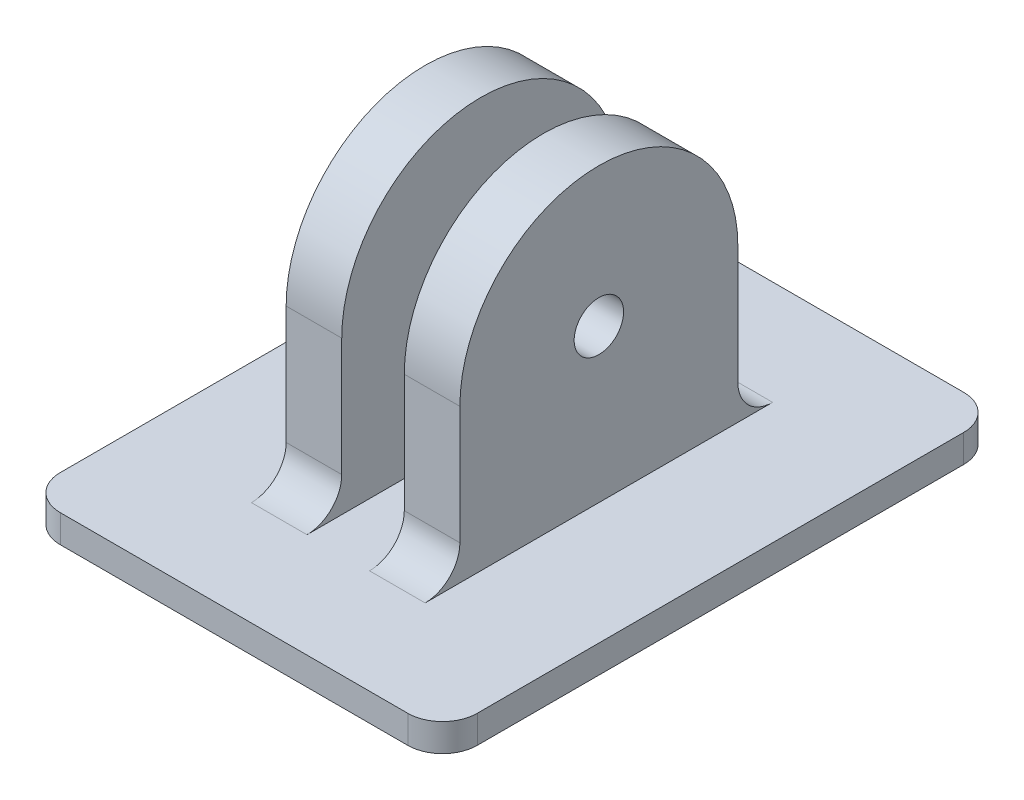
ISO-10303-21;
HEADER;
FILE_DESCRIPTION(('STEP AP214'),'2;1');
FILE_NAME('part.step','',(''),(''),'','','');
FILE_SCHEMA(('AUTOMOTIVE_DESIGN { 1 0 10303 214 1 1 1 1 }'));
ENDSEC;
DATA;
#1=APPLICATION_CONTEXT('core data for automotive mechanical design processes');
#2=APPLICATION_PROTOCOL_DEFINITION('international standard','automotive_design',2000,#1);
#3=PRODUCT_CONTEXT('',#1,'mechanical');
#4=PRODUCT('Part','Part','',(#3));
#5=PRODUCT_RELATED_PRODUCT_CATEGORY('part','',(#4));
#6=PRODUCT_DEFINITION_FORMATION('','',#4);
#7=PRODUCT_DEFINITION_CONTEXT('part definition',#1,'design');
#8=PRODUCT_DEFINITION('design','',#6,#7);
#9=PRODUCT_DEFINITION_SHAPE('','',#8);
#10=(LENGTH_UNIT() NAMED_UNIT(*) SI_UNIT(.MILLI.,.METRE.));
#11=(NAMED_UNIT(*) PLANE_ANGLE_UNIT() SI_UNIT($,.RADIAN.));
#12=(NAMED_UNIT(*) SI_UNIT($,.STERADIAN.) SOLID_ANGLE_UNIT());
#13=UNCERTAINTY_MEASURE_WITH_UNIT(LENGTH_MEASURE(1.E-05),#10,'distance_accuracy_value','');
#14=(GEOMETRIC_REPRESENTATION_CONTEXT(3) GLOBAL_UNCERTAINTY_ASSIGNED_CONTEXT((#13)) GLOBAL_UNIT_ASSIGNED_CONTEXT((#10,
#11,#12)) REPRESENTATION_CONTEXT('',''));
#15=CARTESIAN_POINT('',(0.,0.,0.));
#16=DIRECTION('',(0.,0.,1.));
#17=DIRECTION('',(1.,0.,0.));
#18=AXIS2_PLACEMENT_3D('',#15,#16,#17);
#19=CARTESIAN_POINT('',(0.,2.,0.));
#20=DIRECTION('',(0.,1.,0.));
#21=DIRECTION('',(0.,0.,1.));
#22=AXIS2_PLACEMENT_3D('',#19,#20,#21);
#23=PLANE('',#22);
#24=DIRECTION('',(0.,0.,-1.));
#25=VECTOR('',#24,1.);
#26=CARTESIAN_POINT('',(15.,2.,-20.));
#27=LINE('',#26,#25);
#28=CARTESIAN_POINT('',(15.,2.,17.5));
#29=VERTEX_POINT('',#28);
#30=CARTESIAN_POINT('',(15.,2.,-17.5));
#31=VERTEX_POINT('',#30);
#32=EDGE_CURVE('E251',#29,#31,#27,.T.);
#33=ORIENTED_EDGE('',*,*,#32,.T.);
#34=CARTESIAN_POINT('',(12.5,2.,-17.5));
#35=DIRECTION('',(0.,1.,0.));
#36=DIRECTION('',(0.,0.,1.));
#37=AXIS2_PLACEMENT_3D('',#34,#35,#36);
#38=CIRCLE('',#37,2.5);
#39=CARTESIAN_POINT('',(12.5,2.,-20.));
#40=VERTEX_POINT('',#39);
#41=EDGE_CURVE('E284',#31,#40,#38,.T.);
#42=ORIENTED_EDGE('',*,*,#41,.T.);
#43=DIRECTION('',(-1.,0.,0.));
#44=VECTOR('',#43,1.);
#45=CARTESIAN_POINT('',(-15.,2.,-20.));
#46=LINE('',#45,#44);
#47=CARTESIAN_POINT('',(-12.5,2.,-20.));
#48=VERTEX_POINT('',#47);
#49=EDGE_CURVE('E254',#40,#48,#46,.T.);
#50=ORIENTED_EDGE('',*,*,#49,.T.);
#51=CARTESIAN_POINT('',(-12.5,2.,-17.5));
#52=DIRECTION('',(0.,1.,0.));
#53=DIRECTION('',(0.,0.,1.));
#54=AXIS2_PLACEMENT_3D('',#51,#52,#53);
#55=CIRCLE('',#54,2.5);
#56=CARTESIAN_POINT('',(-15.,2.,-17.5));
#57=VERTEX_POINT('',#56);
#58=EDGE_CURVE('E282',#48,#57,#55,.T.);
#59=ORIENTED_EDGE('',*,*,#58,.T.);
#60=DIRECTION('',(0.,0.,1.));
#61=VECTOR('',#60,1.);
#62=CARTESIAN_POINT('',(-15.,2.,-20.));
#63=LINE('',#62,#61);
#64=CARTESIAN_POINT('',(-15.,2.,17.5));
#65=VERTEX_POINT('',#64);
#66=EDGE_CURVE('E244',#57,#65,#63,.T.);
#67=ORIENTED_EDGE('',*,*,#66,.T.);
#68=CARTESIAN_POINT('',(-12.5,2.,17.5));
#69=DIRECTION('',(0.,1.,0.));
#70=DIRECTION('',(0.,0.,1.));
#71=AXIS2_PLACEMENT_3D('',#68,#69,#70);
#72=CIRCLE('',#71,2.5);
#73=CARTESIAN_POINT('',(-12.5,2.,20.));
#74=VERTEX_POINT('',#73);
#75=EDGE_CURVE('E275',#65,#74,#72,.T.);
#76=ORIENTED_EDGE('',*,*,#75,.T.);
#77=DIRECTION('',(1.,0.,0.));
#78=VECTOR('',#77,1.);
#79=CARTESIAN_POINT('',(-15.,2.,20.));
#80=LINE('',#79,#78);
#81=CARTESIAN_POINT('',(12.5,2.,20.));
#82=VERTEX_POINT('',#81);
#83=EDGE_CURVE('E247',#74,#82,#80,.T.);
#84=ORIENTED_EDGE('',*,*,#83,.T.);
#85=CARTESIAN_POINT('',(12.5,2.,17.5));
#86=DIRECTION('',(0.,1.,0.));
#87=DIRECTION('',(0.,0.,1.));
#88=AXIS2_PLACEMENT_3D('',#85,#86,#87);
#89=CIRCLE('',#88,2.5);
#90=EDGE_CURVE('E277',#82,#29,#89,.T.);
#91=ORIENTED_EDGE('',*,*,#90,.T.);
#92=EDGE_LOOP('',(#33,#42,#50,#59,#67,#76,#84,#91));
#93=FACE_BOUND('',#92,.T.);
#94=DIRECTION('',(0.,0.,1.));
#95=VECTOR('',#94,1.);
#96=CARTESIAN_POINT('',(2.25,2.,-10.));
#97=LINE('',#96,#95);
#98=CARTESIAN_POINT('',(2.25,2.,-12.5));
#99=VERTEX_POINT('',#98);
#100=CARTESIAN_POINT('',(2.25,2.,12.5));
#101=VERTEX_POINT('',#100);
#102=EDGE_CURVE('E233',#99,#101,#97,.T.);
#103=ORIENTED_EDGE('',*,*,#102,.F.);
#104=DIRECTION('',(-1.,0.,0.));
#105=VECTOR('',#104,1.);
#106=CARTESIAN_POINT('',(0.,2.,-12.5));
#107=LINE('',#106,#105);
#108=CARTESIAN_POINT('',(6.25,2.,-12.5));
#109=VERTEX_POINT('',#108);
#110=EDGE_CURVE('E286',#99,#109,#107,.F.);
#111=ORIENTED_EDGE('',*,*,#110,.T.);
#112=DIRECTION('',(0.,0.,-1.));
#113=VECTOR('',#112,1.);
#114=CARTESIAN_POINT('',(6.25,2.,-10.));
#115=LINE('',#114,#113);
#116=CARTESIAN_POINT('',(6.25,2.,12.5));
#117=VERTEX_POINT('',#116);
#118=EDGE_CURVE('E234',#117,#109,#115,.T.);
#119=ORIENTED_EDGE('',*,*,#118,.F.);
#120=DIRECTION('',(1.,0.,0.));
#121=VECTOR('',#120,1.);
#122=CARTESIAN_POINT('',(0.,2.,12.5));
#123=LINE('',#122,#121);
#124=EDGE_CURVE('E272',#117,#101,#123,.F.);
#125=ORIENTED_EDGE('',*,*,#124,.T.);
#126=EDGE_LOOP('',(#103,#111,#119,#125));
#127=FACE_BOUND('',#126,.T.);
#128=DIRECTION('',(0.,0.,1.));
#129=VECTOR('',#128,1.);
#130=CARTESIAN_POINT('',(-6.25,2.,-10.));
#131=LINE('',#130,#129);
#132=CARTESIAN_POINT('',(-6.25,2.,-12.5));
#133=VERTEX_POINT('',#132);
#134=CARTESIAN_POINT('',(-6.25,2.,12.5));
#135=VERTEX_POINT('',#134);
#136=EDGE_CURVE('E217',#133,#135,#131,.T.);
#137=ORIENTED_EDGE('',*,*,#136,.F.);
#138=DIRECTION('',(-1.,0.,0.));
#139=VECTOR('',#138,1.);
#140=CARTESIAN_POINT('',(0.,2.,-12.5));
#141=LINE('',#140,#139);
#142=CARTESIAN_POINT('',(-2.25,2.,-12.5));
#143=VERTEX_POINT('',#142);
#144=EDGE_CURVE('E279',#133,#143,#141,.F.);
#145=ORIENTED_EDGE('',*,*,#144,.T.);
#146=DIRECTION('',(0.,0.,-1.));
#147=VECTOR('',#146,1.);
#148=CARTESIAN_POINT('',(-2.25,2.,-10.));
#149=LINE('',#148,#147);
#150=CARTESIAN_POINT('',(-2.25,2.,12.5));
#151=VERTEX_POINT('',#150);
#152=EDGE_CURVE('E210',#151,#143,#149,.T.);
#153=ORIENTED_EDGE('',*,*,#152,.F.);
#154=DIRECTION('',(1.,0.,0.));
#155=VECTOR('',#154,1.);
#156=CARTESIAN_POINT('',(0.,2.,12.5));
#157=LINE('',#156,#155);
#158=EDGE_CURVE('E269',#151,#135,#157,.F.);
#159=ORIENTED_EDGE('',*,*,#158,.T.);
#160=EDGE_LOOP('',(#137,#145,#153,#159));
#161=FACE_BOUND('',#160,.T.);
#162=ADVANCED_FACE('F36',(#93,#127,#161),#23,.T.);
#163=CARTESIAN_POINT('',(-15.,2.,-20.));
#164=DIRECTION('',(1.,0.,0.));
#165=DIRECTION('',(0.,0.,-1.));
#166=AXIS2_PLACEMENT_3D('',#163,#164,#165);
#167=PLANE('',#166);
#168=ORIENTED_EDGE('',*,*,#66,.F.);
#169=DIRECTION('',(0.,-1.,0.));
#170=VECTOR('',#169,1.);
#171=CARTESIAN_POINT('',(-15.,2.,-17.5));
#172=LINE('',#171,#170);
#173=CARTESIAN_POINT('',(-15.,0.,-17.5));
#174=VERTEX_POINT('',#173);
#175=EDGE_CURVE('E309',#57,#174,#172,.T.);
#176=ORIENTED_EDGE('',*,*,#175,.T.);
#177=DIRECTION('',(0.,0.,1.));
#178=VECTOR('',#177,1.);
#179=CARTESIAN_POINT('',(-15.,0.,-20.));
#180=LINE('',#179,#178);
#181=CARTESIAN_POINT('',(-15.,0.,17.5));
#182=VERTEX_POINT('',#181);
#183=EDGE_CURVE('E243',#174,#182,#180,.T.);
#184=ORIENTED_EDGE('',*,*,#183,.T.);
#185=DIRECTION('',(0.,-1.,0.));
#186=VECTOR('',#185,1.);
#187=CARTESIAN_POINT('',(-15.,2.,17.5));
#188=LINE('',#187,#186);
#189=EDGE_CURVE('E307',#182,#65,#188,.F.);
#190=ORIENTED_EDGE('',*,*,#189,.T.);
#191=EDGE_LOOP('',(#168,#176,#184,#190));
#192=FACE_BOUND('',#191,.T.);
#193=ADVANCED_FACE('F366',(#192),#167,.F.);
#194=CARTESIAN_POINT('',(-15.,2.,20.));
#195=DIRECTION('',(0.,0.,-1.));
#196=DIRECTION('',(-1.,0.,0.));
#197=AXIS2_PLACEMENT_3D('',#194,#195,#196);
#198=PLANE('',#197);
#199=DIRECTION('',(1.,0.,0.));
#200=VECTOR('',#199,1.);
#201=CARTESIAN_POINT('',(-15.,0.,20.));
#202=LINE('',#201,#200);
#203=CARTESIAN_POINT('',(-12.5,0.,20.));
#204=VERTEX_POINT('',#203);
#205=CARTESIAN_POINT('',(12.5,0.,20.));
#206=VERTEX_POINT('',#205);
#207=EDGE_CURVE('E260',#204,#206,#202,.T.);
#208=ORIENTED_EDGE('',*,*,#207,.T.);
#209=DIRECTION('',(0.,-1.,0.));
#210=VECTOR('',#209,1.);
#211=CARTESIAN_POINT('',(12.5,2.,20.));
#212=LINE('',#211,#210);
#213=EDGE_CURVE('E318',#206,#82,#212,.F.);
#214=ORIENTED_EDGE('',*,*,#213,.T.);
#215=ORIENTED_EDGE('',*,*,#83,.F.);
#216=DIRECTION('',(0.,-1.,0.));
#217=VECTOR('',#216,1.);
#218=CARTESIAN_POINT('',(-12.5,2.,20.));
#219=LINE('',#218,#217);
#220=EDGE_CURVE('E315',#74,#204,#219,.T.);
#221=ORIENTED_EDGE('',*,*,#220,.T.);
#222=EDGE_LOOP('',(#208,#214,#215,#221));
#223=FACE_BOUND('',#222,.T.);
#224=ADVANCED_FACE('F372',(#223),#198,.F.);
#225=CARTESIAN_POINT('',(15.,2.,-20.));
#226=DIRECTION('',(-1.,0.,0.));
#227=DIRECTION('',(0.,0.,1.));
#228=AXIS2_PLACEMENT_3D('',#225,#226,#227);
#229=PLANE('',#228);
#230=DIRECTION('',(0.,0.,-1.));
#231=VECTOR('',#230,1.);
#232=CARTESIAN_POINT('',(15.,0.,-20.));
#233=LINE('',#232,#231);
#234=CARTESIAN_POINT('',(15.,0.,17.5));
#235=VERTEX_POINT('',#234);
#236=CARTESIAN_POINT('',(15.,0.,-17.5));
#237=VERTEX_POINT('',#236);
#238=EDGE_CURVE('E263',#235,#237,#233,.T.);
#239=ORIENTED_EDGE('',*,*,#238,.T.);
#240=DIRECTION('',(0.,-1.,0.));
#241=VECTOR('',#240,1.);
#242=CARTESIAN_POINT('',(15.,2.,-17.5));
#243=LINE('',#242,#241);
#244=EDGE_CURVE('E305',#237,#31,#243,.F.);
#245=ORIENTED_EDGE('',*,*,#244,.T.);
#246=ORIENTED_EDGE('',*,*,#32,.F.);
#247=DIRECTION('',(0.,-1.,0.));
#248=VECTOR('',#247,1.);
#249=CARTESIAN_POINT('',(15.,2.,17.5));
#250=LINE('',#249,#248);
#251=EDGE_CURVE('E302',#29,#235,#250,.T.);
#252=ORIENTED_EDGE('',*,*,#251,.T.);
#253=EDGE_LOOP('',(#239,#245,#246,#252));
#254=FACE_BOUND('',#253,.T.);
#255=ADVANCED_FACE('F387',(#254),#229,.F.);
#256=CARTESIAN_POINT('',(-15.,2.,-20.));
#257=DIRECTION('',(0.,0.,1.));
#258=DIRECTION('',(1.,0.,0.));
#259=AXIS2_PLACEMENT_3D('',#256,#257,#258);
#260=PLANE('',#259);
#261=ORIENTED_EDGE('',*,*,#49,.F.);
#262=DIRECTION('',(0.,-1.,0.));
#263=VECTOR('',#262,1.);
#264=CARTESIAN_POINT('',(12.5,2.,-20.));
#265=LINE('',#264,#263);
#266=CARTESIAN_POINT('',(12.5,0.,-20.));
#267=VERTEX_POINT('',#266);
#268=EDGE_CURVE('E291',#40,#267,#265,.T.);
#269=ORIENTED_EDGE('',*,*,#268,.T.);
#270=DIRECTION('',(-1.,0.,0.));
#271=VECTOR('',#270,1.);
#272=CARTESIAN_POINT('',(-15.,0.,-20.));
#273=LINE('',#272,#271);
#274=CARTESIAN_POINT('',(-12.5,0.,-20.));
#275=VERTEX_POINT('',#274);
#276=EDGE_CURVE('E248',#267,#275,#273,.T.);
#277=ORIENTED_EDGE('',*,*,#276,.T.);
#278=DIRECTION('',(0.,-1.,0.));
#279=VECTOR('',#278,1.);
#280=CARTESIAN_POINT('',(-12.5,2.,-20.));
#281=LINE('',#280,#279);
#282=EDGE_CURVE('E289',#275,#48,#281,.F.);
#283=ORIENTED_EDGE('',*,*,#282,.T.);
#284=EDGE_LOOP('',(#261,#269,#277,#283));
#285=FACE_BOUND('',#284,.T.);
#286=ADVANCED_FACE('F383',(#285),#260,.F.);
#287=CARTESIAN_POINT('',(0.,0.,0.));
#288=DIRECTION('',(0.,1.,0.));
#289=DIRECTION('',(0.,0.,1.));
#290=AXIS2_PLACEMENT_3D('',#287,#288,#289);
#291=PLANE('',#290);
#292=ORIENTED_EDGE('',*,*,#276,.F.);
#293=CARTESIAN_POINT('',(12.5,0.,-17.5));
#294=DIRECTION('',(0.,1.,0.));
#295=DIRECTION('',(0.,0.,1.));
#296=AXIS2_PLACEMENT_3D('',#293,#294,#295);
#297=CIRCLE('',#296,2.5);
#298=EDGE_CURVE('E300',#267,#237,#297,.F.);
#299=ORIENTED_EDGE('',*,*,#298,.T.);
#300=ORIENTED_EDGE('',*,*,#238,.F.);
#301=CARTESIAN_POINT('',(12.5,0.,17.5));
#302=DIRECTION('',(0.,1.,0.));
#303=DIRECTION('',(0.,0.,1.));
#304=AXIS2_PLACEMENT_3D('',#301,#302,#303);
#305=CIRCLE('',#304,2.5);
#306=EDGE_CURVE('E296',#235,#206,#305,.F.);
#307=ORIENTED_EDGE('',*,*,#306,.T.);
#308=ORIENTED_EDGE('',*,*,#207,.F.);
#309=CARTESIAN_POINT('',(-12.5,0.,17.5));
#310=DIRECTION('',(0.,1.,0.));
#311=DIRECTION('',(0.,0.,1.));
#312=AXIS2_PLACEMENT_3D('',#309,#310,#311);
#313=CIRCLE('',#312,2.5);
#314=EDGE_CURVE('E294',#204,#182,#313,.F.);
#315=ORIENTED_EDGE('',*,*,#314,.T.);
#316=ORIENTED_EDGE('',*,*,#183,.F.);
#317=CARTESIAN_POINT('',(-12.5,0.,-17.5));
#318=DIRECTION('',(0.,1.,0.));
#319=DIRECTION('',(0.,0.,1.));
#320=AXIS2_PLACEMENT_3D('',#317,#318,#319);
#321=CIRCLE('',#320,2.5);
#322=EDGE_CURVE('E298',#174,#275,#321,.F.);
#323=ORIENTED_EDGE('',*,*,#322,.T.);
#324=EDGE_LOOP('',(#292,#299,#300,#307,#308,#315,#316,#323));
#325=FACE_BOUND('',#324,.T.);
#326=ADVANCED_FACE('F380',(#325),#291,.F.);
#327=CARTESIAN_POINT('',(2.25,13.,-10.));
#328=DIRECTION('',(1.,0.,0.));
#329=DIRECTION('',(0.,0.,-1.));
#330=AXIS2_PLACEMENT_3D('',#327,#328,#329);
#331=PLANE('',#330);
#332=CARTESIAN_POINT('',(2.25,13.,0.));
#333=DIRECTION('',(1.,0.,0.));
#334=DIRECTION('',(0.,0.,-1.));
#335=AXIS2_PLACEMENT_3D('',#332,#333,#334);
#336=CIRCLE('',#335,1.778);
#337=CARTESIAN_POINT('',(2.25,13.,-1.778));
#338=VERTEX_POINT('',#337);
#339=EDGE_CURVE('E199',#338,#338,#336,.T.);
#340=ORIENTED_EDGE('',*,*,#339,.T.);
#341=EDGE_LOOP('',(#340));
#342=FACE_BOUND('',#341,.T.);
#343=ORIENTED_EDGE('',*,*,#102,.T.);
#344=CARTESIAN_POINT('',(2.25,4.5,12.5));
#345=DIRECTION('',(1.,0.,0.));
#346=DIRECTION('',(0.,0.,-1.));
#347=AXIS2_PLACEMENT_3D('',#344,#345,#346);
#348=CIRCLE('',#347,2.5);
#349=CARTESIAN_POINT('',(2.25,4.5,10.));
#350=VERTEX_POINT('',#349);
#351=EDGE_CURVE('E337',#101,#350,#348,.T.);
#352=ORIENTED_EDGE('',*,*,#351,.T.);
#353=DIRECTION('',(0.,-1.,0.));
#354=VECTOR('',#353,1.);
#355=CARTESIAN_POINT('',(2.25,13.,10.));
#356=LINE('',#355,#354);
#357=CARTESIAN_POINT('',(2.25,13.,10.));
#358=VERTEX_POINT('',#357);
#359=EDGE_CURVE('E240',#358,#350,#356,.T.);
#360=ORIENTED_EDGE('',*,*,#359,.F.);
#361=CARTESIAN_POINT('',(2.25,13.,0.));
#362=DIRECTION('',(1.,0.,0.));
#363=DIRECTION('',(0.,0.,1.));
#364=AXIS2_PLACEMENT_3D('',#361,#362,#363);
#365=CIRCLE('',#364,10.);
#366=CARTESIAN_POINT('',(2.25,13.,-10.));
#367=VERTEX_POINT('',#366);
#368=EDGE_CURVE('E198',#367,#358,#365,.T.);
#369=ORIENTED_EDGE('',*,*,#368,.F.);
#370=DIRECTION('',(0.,-1.,0.));
#371=VECTOR('',#370,1.);
#372=CARTESIAN_POINT('',(2.25,13.,-10.));
#373=LINE('',#372,#371);
#374=CARTESIAN_POINT('',(2.25,4.5,-10.));
#375=VERTEX_POINT('',#374);
#376=EDGE_CURVE('E180',#367,#375,#373,.T.);
#377=ORIENTED_EDGE('',*,*,#376,.T.);
#378=CARTESIAN_POINT('',(2.25,4.5,-12.5));
#379=DIRECTION('',(1.,0.,0.));
#380=DIRECTION('',(0.,0.,-1.));
#381=AXIS2_PLACEMENT_3D('',#378,#379,#380);
#382=CIRCLE('',#381,2.5);
#383=EDGE_CURVE('E325',#375,#99,#382,.T.);
#384=ORIENTED_EDGE('',*,*,#383,.T.);
#385=EDGE_LOOP('',(#343,#352,#360,#369,#377,#384));
#386=FACE_BOUND('',#385,.T.);
#387=ADVANCED_FACE('F378',(#342,#386),#331,.F.);
#388=CARTESIAN_POINT('',(2.25,13.,10.));
#389=DIRECTION('',(0.,0.,-1.));
#390=DIRECTION('',(-1.,0.,0.));
#391=AXIS2_PLACEMENT_3D('',#388,#389,#390);
#392=PLANE('',#391);
#393=ORIENTED_EDGE('',*,*,#359,.T.);
#394=DIRECTION('',(1.,0.,0.));
#395=VECTOR('',#394,1.);
#396=CARTESIAN_POINT('',(2.25,4.5,10.));
#397=LINE('',#396,#395);
#398=CARTESIAN_POINT('',(6.25,4.5,10.));
#399=VERTEX_POINT('',#398);
#400=EDGE_CURVE('E320',#350,#399,#397,.T.);
#401=ORIENTED_EDGE('',*,*,#400,.T.);
#402=DIRECTION('',(0.,-1.,0.));
#403=VECTOR('',#402,1.);
#404=CARTESIAN_POINT('',(6.25,13.,10.));
#405=LINE('',#404,#403);
#406=CARTESIAN_POINT('',(6.25,13.,10.));
#407=VERTEX_POINT('',#406);
#408=EDGE_CURVE('E194',#407,#399,#405,.T.);
#409=ORIENTED_EDGE('',*,*,#408,.F.);
#410=DIRECTION('',(1.,0.,0.));
#411=VECTOR('',#410,1.);
#412=CARTESIAN_POINT('',(2.25,13.,10.));
#413=LINE('',#412,#411);
#414=EDGE_CURVE('E185',#358,#407,#413,.T.);
#415=ORIENTED_EDGE('',*,*,#414,.F.);
#416=EDGE_LOOP('',(#393,#401,#409,#415));
#417=FACE_BOUND('',#416,.T.);
#418=ADVANCED_FACE('F429',(#417),#392,.F.);
#419=CARTESIAN_POINT('',(6.25,13.,-10.));
#420=DIRECTION('',(-1.,0.,0.));
#421=DIRECTION('',(0.,0.,1.));
#422=AXIS2_PLACEMENT_3D('',#419,#420,#421);
#423=PLANE('',#422);
#424=CARTESIAN_POINT('',(6.25,13.,0.));
#425=DIRECTION('',(1.,0.,0.));
#426=DIRECTION('',(0.,0.,-1.));
#427=AXIS2_PLACEMENT_3D('',#424,#425,#426);
#428=CIRCLE('',#427,1.778);
#429=CARTESIAN_POINT('',(6.25,13.,-1.778));
#430=VERTEX_POINT('',#429);
#431=EDGE_CURVE('E621',#430,#430,#428,.T.);
#432=ORIENTED_EDGE('',*,*,#431,.F.);
#433=EDGE_LOOP('',(#432));
#434=FACE_BOUND('',#433,.T.);
#435=ORIENTED_EDGE('',*,*,#118,.T.);
#436=CARTESIAN_POINT('',(6.25,4.5,-12.5));
#437=DIRECTION('',(-1.,0.,0.));
#438=DIRECTION('',(0.,0.,1.));
#439=AXIS2_PLACEMENT_3D('',#436,#437,#438);
#440=CIRCLE('',#439,2.5);
#441=CARTESIAN_POINT('',(6.25,4.5,-10.));
#442=VERTEX_POINT('',#441);
#443=EDGE_CURVE('E193',#109,#442,#440,.T.);
#444=ORIENTED_EDGE('',*,*,#443,.T.);
#445=DIRECTION('',(0.,-1.,0.));
#446=VECTOR('',#445,1.);
#447=CARTESIAN_POINT('',(6.25,13.,-10.));
#448=LINE('',#447,#446);
#449=CARTESIAN_POINT('',(6.25,13.,-9.99999999999999));
#450=VERTEX_POINT('',#449);
#451=EDGE_CURVE('E177',#450,#442,#448,.T.);
#452=ORIENTED_EDGE('',*,*,#451,.F.);
#453=CARTESIAN_POINT('',(6.25,13.,0.));
#454=DIRECTION('',(1.,0.,0.));
#455=DIRECTION('',(0.,0.,1.));
#456=AXIS2_PLACEMENT_3D('',#453,#454,#455);
#457=CIRCLE('',#456,10.);
#458=EDGE_CURVE('E191',#450,#407,#457,.T.);
#459=ORIENTED_EDGE('',*,*,#458,.T.);
#460=ORIENTED_EDGE('',*,*,#408,.T.);
#461=CARTESIAN_POINT('',(6.25,4.5,12.5));
#462=DIRECTION('',(-1.,0.,0.));
#463=DIRECTION('',(0.,0.,1.));
#464=AXIS2_PLACEMENT_3D('',#461,#462,#463);
#465=CIRCLE('',#464,2.5);
#466=EDGE_CURVE('E334',#399,#117,#465,.T.);
#467=ORIENTED_EDGE('',*,*,#466,.T.);
#468=EDGE_LOOP('',(#435,#444,#452,#459,#460,#467));
#469=FACE_BOUND('',#468,.T.);
#470=ADVANCED_FACE('F189',(#434,#469),#423,.F.);
#471=CARTESIAN_POINT('',(2.25,13.,-10.));
#472=DIRECTION('',(0.,0.,1.));
#473=DIRECTION('',(1.,0.,0.));
#474=AXIS2_PLACEMENT_3D('',#471,#472,#473);
#475=PLANE('',#474);
#476=ORIENTED_EDGE('',*,*,#451,.T.);
#477=DIRECTION('',(-1.,0.,0.));
#478=VECTOR('',#477,1.);
#479=CARTESIAN_POINT('',(2.25,4.5,-10.));
#480=LINE('',#479,#478);
#481=EDGE_CURVE('E257',#442,#375,#480,.T.);
#482=ORIENTED_EDGE('',*,*,#481,.T.);
#483=ORIENTED_EDGE('',*,*,#376,.F.);
#484=DIRECTION('',(-1.,0.,0.));
#485=VECTOR('',#484,1.);
#486=CARTESIAN_POINT('',(2.25,13.,-10.));
#487=LINE('',#486,#485);
#488=EDGE_CURVE('E173',#450,#367,#487,.T.);
#489=ORIENTED_EDGE('',*,*,#488,.F.);
#490=EDGE_LOOP('',(#476,#482,#483,#489));
#491=FACE_BOUND('',#490,.T.);
#492=ADVANCED_FACE('F175',(#491),#475,.F.);
#493=CARTESIAN_POINT('',(-2.25,13.,-10.));
#494=DIRECTION('',(-1.,0.,0.));
#495=DIRECTION('',(0.,0.,1.));
#496=AXIS2_PLACEMENT_3D('',#493,#494,#495);
#497=PLANE('',#496);
#498=CARTESIAN_POINT('',(-2.25,13.,0.));
#499=DIRECTION('',(-1.,0.,0.));
#500=DIRECTION('',(0.,0.,1.));
#501=AXIS2_PLACEMENT_3D('',#498,#499,#500);
#502=CIRCLE('',#501,1.778);
#503=CARTESIAN_POINT('',(-2.25,13.,1.778));
#504=VERTEX_POINT('',#503);
#505=EDGE_CURVE('E204',#504,#504,#502,.T.);
#506=ORIENTED_EDGE('',*,*,#505,.T.);
#507=EDGE_LOOP('',(#506));
#508=FACE_BOUND('',#507,.T.);
#509=ORIENTED_EDGE('',*,*,#152,.T.);
#510=CARTESIAN_POINT('',(-2.25,4.5,-12.5));
#511=DIRECTION('',(-1.,0.,0.));
#512=DIRECTION('',(0.,0.,1.));
#513=AXIS2_PLACEMENT_3D('',#510,#511,#512);
#514=CIRCLE('',#513,2.5);
#515=CARTESIAN_POINT('',(-2.25,4.5,-10.));
#516=VERTEX_POINT('',#515);
#517=EDGE_CURVE('E332',#143,#516,#514,.T.);
#518=ORIENTED_EDGE('',*,*,#517,.T.);
#519=DIRECTION('',(0.,-1.,0.));
#520=VECTOR('',#519,1.);
#521=CARTESIAN_POINT('',(-2.25,13.,-10.));
#522=LINE('',#521,#520);
#523=CARTESIAN_POINT('',(-2.25,13.,-10.));
#524=VERTEX_POINT('',#523);
#525=EDGE_CURVE('E230',#524,#516,#522,.T.);
#526=ORIENTED_EDGE('',*,*,#525,.F.);
#527=CARTESIAN_POINT('',(-2.25,13.,0.));
#528=DIRECTION('',(-1.,0.,0.));
#529=DIRECTION('',(0.,0.,-1.));
#530=AXIS2_PLACEMENT_3D('',#527,#528,#529);
#531=CIRCLE('',#530,9.99999999999999);
#532=CARTESIAN_POINT('',(-2.25,13.,10.));
#533=VERTEX_POINT('',#532);
#534=EDGE_CURVE('E207',#533,#524,#531,.T.);
#535=ORIENTED_EDGE('',*,*,#534,.F.);
#536=DIRECTION('',(0.,-1.,0.));
#537=VECTOR('',#536,1.);
#538=CARTESIAN_POINT('',(-2.25,13.,10.));
#539=LINE('',#538,#537);
#540=CARTESIAN_POINT('',(-2.25,4.5,10.));
#541=VERTEX_POINT('',#540);
#542=EDGE_CURVE('E220',#533,#541,#539,.T.);
#543=ORIENTED_EDGE('',*,*,#542,.T.);
#544=CARTESIAN_POINT('',(-2.25,4.5,12.5));
#545=DIRECTION('',(-1.,0.,0.));
#546=DIRECTION('',(0.,0.,1.));
#547=AXIS2_PLACEMENT_3D('',#544,#545,#546);
#548=CIRCLE('',#547,2.5);
#549=EDGE_CURVE('E44',#541,#151,#548,.T.);
#550=ORIENTED_EDGE('',*,*,#549,.T.);
#551=EDGE_LOOP('',(#509,#518,#526,#535,#543,#550));
#552=FACE_BOUND('',#551,.T.);
#553=ADVANCED_FACE('F339',(#508,#552),#497,.F.);
#554=CARTESIAN_POINT('',(-2.25,13.,-10.));
#555=DIRECTION('',(0.,0.,1.));
#556=DIRECTION('',(1.,0.,0.));
#557=AXIS2_PLACEMENT_3D('',#554,#555,#556);
#558=PLANE('',#557);
#559=ORIENTED_EDGE('',*,*,#525,.T.);
#560=DIRECTION('',(-1.,0.,0.));
#561=VECTOR('',#560,1.);
#562=CARTESIAN_POINT('',(-2.25,4.5,-10.));
#563=LINE('',#562,#561);
#564=CARTESIAN_POINT('',(-6.25,4.5,-10.));
#565=VERTEX_POINT('',#564);
#566=EDGE_CURVE('E312',#516,#565,#563,.T.);
#567=ORIENTED_EDGE('',*,*,#566,.T.);
#568=DIRECTION('',(0.,-1.,0.));
#569=VECTOR('',#568,1.);
#570=CARTESIAN_POINT('',(-6.25,13.,-10.));
#571=LINE('',#570,#569);
#572=CARTESIAN_POINT('',(-6.25,13.,-10.));
#573=VERTEX_POINT('',#572);
#574=EDGE_CURVE('E227',#573,#565,#571,.T.);
#575=ORIENTED_EDGE('',*,*,#574,.F.);
#576=DIRECTION('',(-1.,0.,0.));
#577=VECTOR('',#576,1.);
#578=CARTESIAN_POINT('',(-2.25,13.,-10.));
#579=LINE('',#578,#577);
#580=EDGE_CURVE('E213',#524,#573,#579,.T.);
#581=ORIENTED_EDGE('',*,*,#580,.F.);
#582=EDGE_LOOP('',(#559,#567,#575,#581));
#583=FACE_BOUND('',#582,.T.);
#584=ADVANCED_FACE('F349',(#583),#558,.F.);
#585=CARTESIAN_POINT('',(-6.25,13.,-10.));
#586=DIRECTION('',(1.,0.,0.));
#587=DIRECTION('',(0.,0.,-1.));
#588=AXIS2_PLACEMENT_3D('',#585,#586,#587);
#589=PLANE('',#588);
#590=CARTESIAN_POINT('',(-6.25,13.,0.));
#591=DIRECTION('',(1.,0.,0.));
#592=DIRECTION('',(0.,0.,-1.));
#593=AXIS2_PLACEMENT_3D('',#590,#591,#592);
#594=CIRCLE('',#593,1.778);
#595=CARTESIAN_POINT('',(-6.25,13.,-1.778));
#596=VERTEX_POINT('',#595);
#597=EDGE_CURVE('E617',#596,#596,#594,.F.);
#598=ORIENTED_EDGE('',*,*,#597,.F.);
#599=EDGE_LOOP('',(#598));
#600=FACE_BOUND('',#599,.T.);
#601=ORIENTED_EDGE('',*,*,#136,.T.);
#602=CARTESIAN_POINT('',(-6.25,4.5,12.5));
#603=DIRECTION('',(1.,0.,0.));
#604=DIRECTION('',(0.,0.,-1.));
#605=AXIS2_PLACEMENT_3D('',#602,#603,#604);
#606=CIRCLE('',#605,2.5);
#607=CARTESIAN_POINT('',(-6.25,4.5,10.));
#608=VERTEX_POINT('',#607);
#609=EDGE_CURVE('E11',#135,#608,#606,.T.);
#610=ORIENTED_EDGE('',*,*,#609,.T.);
#611=DIRECTION('',(0.,-1.,0.));
#612=VECTOR('',#611,1.);
#613=CARTESIAN_POINT('',(-6.25,13.,10.));
#614=LINE('',#613,#612);
#615=CARTESIAN_POINT('',(-6.25,13.,9.99999999999999));
#616=VERTEX_POINT('',#615);
#617=EDGE_CURVE('E225',#616,#608,#614,.T.);
#618=ORIENTED_EDGE('',*,*,#617,.F.);
#619=CARTESIAN_POINT('',(-6.25,13.,0.));
#620=DIRECTION('',(-1.,0.,0.));
#621=DIRECTION('',(0.,0.,-1.));
#622=AXIS2_PLACEMENT_3D('',#619,#620,#621);
#623=CIRCLE('',#622,9.99999999999999);
#624=EDGE_CURVE('E201',#616,#573,#623,.T.);
#625=ORIENTED_EDGE('',*,*,#624,.T.);
#626=ORIENTED_EDGE('',*,*,#574,.T.);
#627=CARTESIAN_POINT('',(-6.25,4.5,-12.5));
#628=DIRECTION('',(1.,0.,0.));
#629=DIRECTION('',(0.,0.,-1.));
#630=AXIS2_PLACEMENT_3D('',#627,#628,#629);
#631=CIRCLE('',#630,2.5);
#632=EDGE_CURVE('E329',#565,#133,#631,.T.);
#633=ORIENTED_EDGE('',*,*,#632,.T.);
#634=EDGE_LOOP('',(#601,#610,#618,#625,#626,#633));
#635=FACE_BOUND('',#634,.T.);
#636=ADVANCED_FACE('F353',(#600,#635),#589,.F.);
#637=CARTESIAN_POINT('',(-2.25,13.,10.));
#638=DIRECTION('',(0.,0.,-1.));
#639=DIRECTION('',(-1.,0.,0.));
#640=AXIS2_PLACEMENT_3D('',#637,#638,#639);
#641=PLANE('',#640);
#642=ORIENTED_EDGE('',*,*,#617,.T.);
#643=DIRECTION('',(1.,0.,0.));
#644=VECTOR('',#643,1.);
#645=CARTESIAN_POINT('',(-2.25,4.5,10.));
#646=LINE('',#645,#644);
#647=EDGE_CURVE('E323',#608,#541,#646,.T.);
#648=ORIENTED_EDGE('',*,*,#647,.T.);
#649=ORIENTED_EDGE('',*,*,#542,.F.);
#650=DIRECTION('',(1.,0.,0.));
#651=VECTOR('',#650,1.);
#652=CARTESIAN_POINT('',(-2.25,13.,10.));
#653=LINE('',#652,#651);
#654=EDGE_CURVE('E216',#616,#533,#653,.T.);
#655=ORIENTED_EDGE('',*,*,#654,.F.);
#656=EDGE_LOOP('',(#642,#648,#649,#655));
#657=FACE_BOUND('',#656,.T.);
#658=ADVANCED_FACE('F355',(#657),#641,.F.);
#659=CARTESIAN_POINT('',(-2.25,13.,0.));
#660=DIRECTION('',(-1.,0.,0.));
#661=DIRECTION('',(0.,0.,1.));
#662=AXIS2_PLACEMENT_3D('',#659,#660,#661);
#663=CYLINDRICAL_SURFACE('',#662,9.99999999999999);
#664=ORIENTED_EDGE('',*,*,#624,.F.);
#665=ORIENTED_EDGE('',*,*,#654,.T.);
#666=ORIENTED_EDGE('',*,*,#534,.T.);
#667=ORIENTED_EDGE('',*,*,#580,.T.);
#668=EDGE_LOOP('',(#664,#665,#666,#667));
#669=FACE_BOUND('',#668,.T.);
#670=ADVANCED_FACE('F352',(#669),#663,.T.);
#671=CARTESIAN_POINT('',(2.25,13.,0.));
#672=DIRECTION('',(1.,0.,0.));
#673=DIRECTION('',(0.,0.,-1.));
#674=AXIS2_PLACEMENT_3D('',#671,#672,#673);
#675=CYLINDRICAL_SURFACE('',#674,10.);
#676=ORIENTED_EDGE('',*,*,#458,.F.);
#677=ORIENTED_EDGE('',*,*,#488,.T.);
#678=ORIENTED_EDGE('',*,*,#368,.T.);
#679=ORIENTED_EDGE('',*,*,#414,.T.);
#680=EDGE_LOOP('',(#676,#677,#678,#679));
#681=FACE_BOUND('',#680,.T.);
#682=ADVANCED_FACE('F197',(#681),#675,.T.);
#683=CARTESIAN_POINT('',(-11.2789434277987,13.,0.));
#684=DIRECTION('',(1.,0.,0.));
#685=DIRECTION('',(0.,0.,-1.));
#686=AXIS2_PLACEMENT_3D('',#683,#684,#685);
#687=CYLINDRICAL_SURFACE('',#686,1.778);
#688=ORIENTED_EDGE('',*,*,#597,.T.);
#689=EDGE_LOOP('',(#688));
#690=FACE_BOUND('',#689,.T.);
#691=ORIENTED_EDGE('',*,*,#505,.F.);
#692=EDGE_LOOP('',(#691));
#693=FACE_BOUND('',#692,.T.);
#694=ADVANCED_FACE('F516',(#690,#693),#687,.F.);
#695=ORIENTED_EDGE('',*,*,#431,.T.);
#696=EDGE_LOOP('',(#695));
#697=FACE_BOUND('',#696,.T.);
#698=ORIENTED_EDGE('',*,*,#339,.F.);
#699=EDGE_LOOP('',(#698));
#700=FACE_BOUND('',#699,.T.);
#701=ADVANCED_FACE('F399',(#697,#700),#687,.F.);
#702=CARTESIAN_POINT('',(2.25,4.5,-12.5));
#703=DIRECTION('',(-1.,0.,0.));
#704=DIRECTION('',(0.,0.,1.));
#705=AXIS2_PLACEMENT_3D('',#702,#703,#704);
#706=CYLINDRICAL_SURFACE('',#705,2.5);
#707=ORIENTED_EDGE('',*,*,#443,.F.);
#708=ORIENTED_EDGE('',*,*,#110,.F.);
#709=ORIENTED_EDGE('',*,*,#383,.F.);
#710=ORIENTED_EDGE('',*,*,#481,.F.);
#711=EDGE_LOOP('',(#707,#708,#709,#710));
#712=FACE_BOUND('',#711,.T.);
#713=ADVANCED_FACE('F395',(#712),#706,.F.);
#714=CARTESIAN_POINT('',(12.5,2.,-17.5));
#715=DIRECTION('',(0.,-1.,0.));
#716=DIRECTION('',(0.,0.,-1.));
#717=AXIS2_PLACEMENT_3D('',#714,#715,#716);
#718=CYLINDRICAL_SURFACE('',#717,2.5);
#719=ORIENTED_EDGE('',*,*,#41,.F.);
#720=ORIENTED_EDGE('',*,*,#244,.F.);
#721=ORIENTED_EDGE('',*,*,#298,.F.);
#722=ORIENTED_EDGE('',*,*,#268,.F.);
#723=EDGE_LOOP('',(#719,#720,#721,#722));
#724=FACE_BOUND('',#723,.T.);
#725=ADVANCED_FACE('F398',(#724),#718,.T.);
#726=CARTESIAN_POINT('',(-12.5,2.,-17.5));
#727=DIRECTION('',(0.,-1.,0.));
#728=DIRECTION('',(0.,0.,-1.));
#729=AXIS2_PLACEMENT_3D('',#726,#727,#728);
#730=CYLINDRICAL_SURFACE('',#729,2.5);
#731=ORIENTED_EDGE('',*,*,#58,.F.);
#732=ORIENTED_EDGE('',*,*,#282,.F.);
#733=ORIENTED_EDGE('',*,*,#322,.F.);
#734=ORIENTED_EDGE('',*,*,#175,.F.);
#735=EDGE_LOOP('',(#731,#732,#733,#734));
#736=FACE_BOUND('',#735,.T.);
#737=ADVANCED_FACE('F403',(#736),#730,.T.);
#738=CARTESIAN_POINT('',(-2.25,4.5,-12.5));
#739=DIRECTION('',(-1.,0.,0.));
#740=DIRECTION('',(0.,0.,1.));
#741=AXIS2_PLACEMENT_3D('',#738,#739,#740);
#742=CYLINDRICAL_SURFACE('',#741,2.5);
#743=ORIENTED_EDGE('',*,*,#517,.F.);
#744=ORIENTED_EDGE('',*,*,#144,.F.);
#745=ORIENTED_EDGE('',*,*,#632,.F.);
#746=ORIENTED_EDGE('',*,*,#566,.F.);
#747=EDGE_LOOP('',(#743,#744,#745,#746));
#748=FACE_BOUND('',#747,.T.);
#749=ADVANCED_FACE('F346',(#748),#742,.F.);
#750=CARTESIAN_POINT('',(12.5,2.,17.5));
#751=DIRECTION('',(0.,-1.,0.));
#752=DIRECTION('',(0.,0.,-1.));
#753=AXIS2_PLACEMENT_3D('',#750,#751,#752);
#754=CYLINDRICAL_SURFACE('',#753,2.5);
#755=ORIENTED_EDGE('',*,*,#90,.F.);
#756=ORIENTED_EDGE('',*,*,#213,.F.);
#757=ORIENTED_EDGE('',*,*,#306,.F.);
#758=ORIENTED_EDGE('',*,*,#251,.F.);
#759=EDGE_LOOP('',(#755,#756,#757,#758));
#760=FACE_BOUND('',#759,.T.);
#761=ADVANCED_FACE('F410',(#760),#754,.T.);
#762=CARTESIAN_POINT('',(-12.5,2.,17.5));
#763=DIRECTION('',(0.,-1.,0.));
#764=DIRECTION('',(0.,0.,-1.));
#765=AXIS2_PLACEMENT_3D('',#762,#763,#764);
#766=CYLINDRICAL_SURFACE('',#765,2.5);
#767=ORIENTED_EDGE('',*,*,#75,.F.);
#768=ORIENTED_EDGE('',*,*,#189,.F.);
#769=ORIENTED_EDGE('',*,*,#314,.F.);
#770=ORIENTED_EDGE('',*,*,#220,.F.);
#771=EDGE_LOOP('',(#767,#768,#769,#770));
#772=FACE_BOUND('',#771,.T.);
#773=ADVANCED_FACE('F413',(#772),#766,.T.);
#774=CARTESIAN_POINT('',(2.25,4.5,12.5));
#775=DIRECTION('',(1.,0.,0.));
#776=DIRECTION('',(0.,0.,-1.));
#777=AXIS2_PLACEMENT_3D('',#774,#775,#776);
#778=CYLINDRICAL_SURFACE('',#777,2.5);
#779=ORIENTED_EDGE('',*,*,#351,.F.);
#780=ORIENTED_EDGE('',*,*,#124,.F.);
#781=ORIENTED_EDGE('',*,*,#466,.F.);
#782=ORIENTED_EDGE('',*,*,#400,.F.);
#783=EDGE_LOOP('',(#779,#780,#781,#782));
#784=FACE_BOUND('',#783,.T.);
#785=ADVANCED_FACE('F416',(#784),#778,.F.);
#786=CARTESIAN_POINT('',(-2.25,4.5,12.5));
#787=DIRECTION('',(1.,0.,0.));
#788=DIRECTION('',(0.,0.,-1.));
#789=AXIS2_PLACEMENT_3D('',#786,#787,#788);
#790=CYLINDRICAL_SURFACE('',#789,2.5);
#791=ORIENTED_EDGE('',*,*,#609,.F.);
#792=ORIENTED_EDGE('',*,*,#158,.F.);
#793=ORIENTED_EDGE('',*,*,#549,.F.);
#794=ORIENTED_EDGE('',*,*,#647,.F.);
#795=EDGE_LOOP('',(#791,#792,#793,#794));
#796=FACE_BOUND('',#795,.T.);
#797=ADVANCED_FACE('F38',(#796),#790,.F.);
#798=CLOSED_SHELL('',(#162,#193,#224,#255,#286,#326,#387,#418,#470,#492,#553,#584,#636,#658,
#670,#682,#694,#701,#713,#725,#737,#749,#761,#773,#785,#797));
#799=MANIFOLD_SOLID_BREP('B2',#798);
#800=ADVANCED_BREP_SHAPE_REPRESENTATION('',(#18,#799),#14);
#801=SHAPE_DEFINITION_REPRESENTATION(#9,#800);
ENDSEC;
END-ISO-10303-21;
